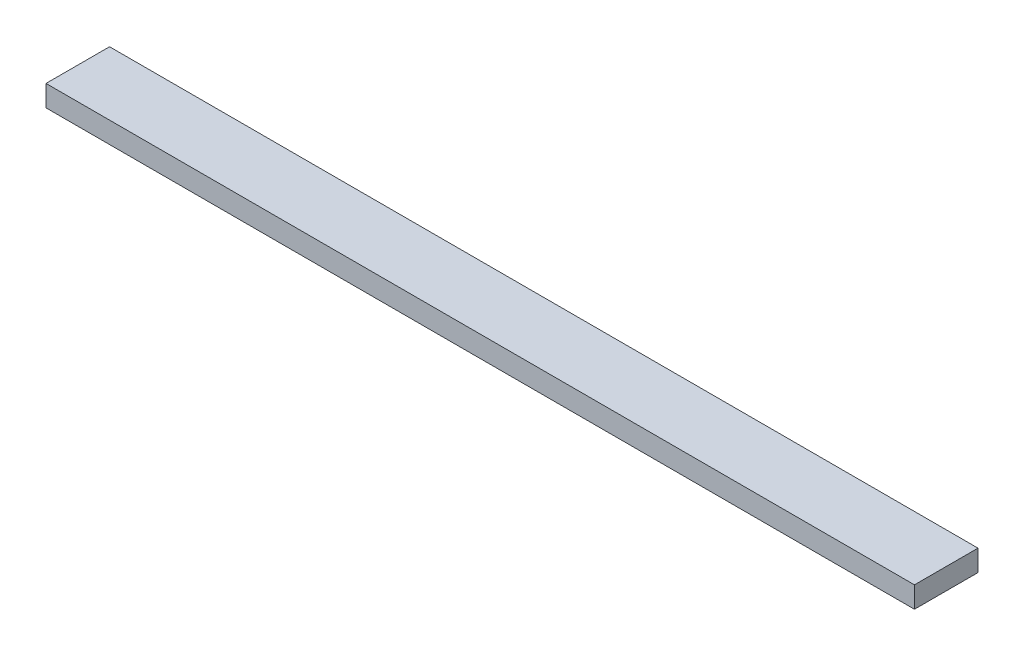
ISO-10303-21;
HEADER;
FILE_DESCRIPTION(('STEP AP214'),'2;1');
FILE_NAME('part.step','',(''),(''),'','','');
FILE_SCHEMA(('AUTOMOTIVE_DESIGN { 1 0 10303 214 1 1 1 1 }'));
ENDSEC;
DATA;
#1=APPLICATION_CONTEXT('core data for automotive mechanical design processes');
#2=APPLICATION_PROTOCOL_DEFINITION('international standard','automotive_design',2000,#1);
#3=PRODUCT_CONTEXT('',#1,'mechanical');
#4=PRODUCT('Part','Part','',(#3));
#5=PRODUCT_RELATED_PRODUCT_CATEGORY('part','',(#4));
#6=PRODUCT_DEFINITION_FORMATION('','',#4);
#7=PRODUCT_DEFINITION_CONTEXT('part definition',#1,'design');
#8=PRODUCT_DEFINITION('design','',#6,#7);
#9=PRODUCT_DEFINITION_SHAPE('','',#8);
#10=(LENGTH_UNIT() NAMED_UNIT(*) SI_UNIT(.MILLI.,.METRE.));
#11=(NAMED_UNIT(*) PLANE_ANGLE_UNIT() SI_UNIT($,.RADIAN.));
#12=(NAMED_UNIT(*) SI_UNIT($,.STERADIAN.) SOLID_ANGLE_UNIT());
#13=UNCERTAINTY_MEASURE_WITH_UNIT(LENGTH_MEASURE(1.E-05),#10,'distance_accuracy_value','');
#14=(GEOMETRIC_REPRESENTATION_CONTEXT(3) GLOBAL_UNCERTAINTY_ASSIGNED_CONTEXT((#13)) GLOBAL_UNIT_ASSIGNED_CONTEXT((#10,
#11,#12)) REPRESENTATION_CONTEXT('',''));
#15=CARTESIAN_POINT('',(0.,0.,0.));
#16=DIRECTION('',(0.,0.,1.));
#17=DIRECTION('',(1.,0.,0.));
#18=AXIS2_PLACEMENT_3D('',#15,#16,#17);
#19=CARTESIAN_POINT('',(-205.,10.,-15.));
#20=DIRECTION('',(1.,0.,0.));
#21=DIRECTION('',(0.,0.,-1.));
#22=AXIS2_PLACEMENT_3D('',#19,#20,#21);
#23=PLANE('',#22);
#24=DIRECTION('',(0.,0.,1.));
#25=VECTOR('',#24,1.);
#26=CARTESIAN_POINT('',(-205.,0.,-15.));
#27=LINE('',#26,#25);
#28=CARTESIAN_POINT('',(-205.,0.,-15.));
#29=VERTEX_POINT('',#28);
#30=CARTESIAN_POINT('',(-205.,0.,15.));
#31=VERTEX_POINT('',#30);
#32=EDGE_CURVE('E97',#29,#31,#27,.T.);
#33=ORIENTED_EDGE('',*,*,#32,.T.);
#34=DIRECTION('',(0.,-1.,0.));
#35=VECTOR('',#34,1.);
#36=CARTESIAN_POINT('',(-205.,10.,15.));
#37=LINE('',#36,#35);
#38=CARTESIAN_POINT('',(-205.,10.,15.));
#39=VERTEX_POINT('',#38);
#40=EDGE_CURVE('E11',#39,#31,#37,.T.);
#41=ORIENTED_EDGE('',*,*,#40,.F.);
#42=DIRECTION('',(0.,0.,1.));
#43=VECTOR('',#42,1.);
#44=CARTESIAN_POINT('',(-205.,10.,-15.));
#45=LINE('',#44,#43);
#46=CARTESIAN_POINT('',(-205.,10.,-15.));
#47=VERTEX_POINT('',#46);
#48=EDGE_CURVE('E85',#47,#39,#45,.T.);
#49=ORIENTED_EDGE('',*,*,#48,.F.);
#50=DIRECTION('',(0.,-1.,0.));
#51=VECTOR('',#50,1.);
#52=CARTESIAN_POINT('',(-205.,10.,-15.));
#53=LINE('',#52,#51);
#54=EDGE_CURVE('E93',#47,#29,#53,.T.);
#55=ORIENTED_EDGE('',*,*,#54,.T.);
#56=EDGE_LOOP('',(#33,#41,#49,#55));
#57=FACE_BOUND('',#56,.T.);
#58=ADVANCED_FACE('F34',(#57),#23,.F.);
#59=CARTESIAN_POINT('',(-205.,10.,15.));
#60=DIRECTION('',(0.,0.,-1.));
#61=DIRECTION('',(-1.,0.,0.));
#62=AXIS2_PLACEMENT_3D('',#59,#60,#61);
#63=PLANE('',#62);
#64=DIRECTION('',(1.,0.,0.));
#65=VECTOR('',#64,1.);
#66=CARTESIAN_POINT('',(-205.,0.,15.));
#67=LINE('',#66,#65);
#68=CARTESIAN_POINT('',(205.,0.,15.));
#69=VERTEX_POINT('',#68);
#70=EDGE_CURVE('E89',#31,#69,#67,.T.);
#71=ORIENTED_EDGE('',*,*,#70,.T.);
#72=DIRECTION('',(0.,-1.,0.));
#73=VECTOR('',#72,1.);
#74=CARTESIAN_POINT('',(205.,10.,15.));
#75=LINE('',#74,#73);
#76=CARTESIAN_POINT('',(205.,10.,15.));
#77=VERTEX_POINT('',#76);
#78=EDGE_CURVE('E42',#77,#69,#75,.T.);
#79=ORIENTED_EDGE('',*,*,#78,.F.);
#80=DIRECTION('',(1.,0.,0.));
#81=VECTOR('',#80,1.);
#82=CARTESIAN_POINT('',(-205.,10.,15.));
#83=LINE('',#82,#81);
#84=EDGE_CURVE('E80',#39,#77,#83,.T.);
#85=ORIENTED_EDGE('',*,*,#84,.F.);
#86=ORIENTED_EDGE('',*,*,#40,.T.);
#87=EDGE_LOOP('',(#71,#79,#85,#86));
#88=FACE_BOUND('',#87,.T.);
#89=ADVANCED_FACE('F88',(#88),#63,.F.);
#90=CARTESIAN_POINT('',(205.,10.,-15.));
#91=DIRECTION('',(-1.,0.,0.));
#92=DIRECTION('',(0.,0.,1.));
#93=AXIS2_PLACEMENT_3D('',#90,#91,#92);
#94=PLANE('',#93);
#95=DIRECTION('',(0.,0.,-1.));
#96=VECTOR('',#95,1.);
#97=CARTESIAN_POINT('',(205.,0.,-15.));
#98=LINE('',#97,#96);
#99=CARTESIAN_POINT('',(205.,0.,-15.));
#100=VERTEX_POINT('',#99);
#101=EDGE_CURVE('E67',#69,#100,#98,.T.);
#102=ORIENTED_EDGE('',*,*,#101,.T.);
#103=DIRECTION('',(0.,-1.,0.));
#104=VECTOR('',#103,1.);
#105=CARTESIAN_POINT('',(205.,10.,-15.));
#106=LINE('',#105,#104);
#107=CARTESIAN_POINT('',(205.,10.,-15.));
#108=VERTEX_POINT('',#107);
#109=EDGE_CURVE('E90',#108,#100,#106,.T.);
#110=ORIENTED_EDGE('',*,*,#109,.F.);
#111=DIRECTION('',(0.,0.,-1.));
#112=VECTOR('',#111,1.);
#113=CARTESIAN_POINT('',(205.,10.,-15.));
#114=LINE('',#113,#112);
#115=EDGE_CURVE('E83',#77,#108,#114,.T.);
#116=ORIENTED_EDGE('',*,*,#115,.F.);
#117=ORIENTED_EDGE('',*,*,#78,.T.);
#118=EDGE_LOOP('',(#102,#110,#116,#117));
#119=FACE_BOUND('',#118,.T.);
#120=ADVANCED_FACE('F91',(#119),#94,.F.);
#121=CARTESIAN_POINT('',(-205.,10.,-15.));
#122=DIRECTION('',(0.,0.,1.));
#123=DIRECTION('',(1.,0.,0.));
#124=AXIS2_PLACEMENT_3D('',#121,#122,#123);
#125=PLANE('',#124);
#126=DIRECTION('',(-1.,0.,0.));
#127=VECTOR('',#126,1.);
#128=CARTESIAN_POINT('',(-205.,0.,-15.));
#129=LINE('',#128,#127);
#130=EDGE_CURVE('E73',#100,#29,#129,.T.);
#131=ORIENTED_EDGE('',*,*,#130,.T.);
#132=ORIENTED_EDGE('',*,*,#54,.F.);
#133=DIRECTION('',(-1.,0.,0.));
#134=VECTOR('',#133,1.);
#135=CARTESIAN_POINT('',(-205.,10.,-15.));
#136=LINE('',#135,#134);
#137=EDGE_CURVE('E50',#108,#47,#136,.T.);
#138=ORIENTED_EDGE('',*,*,#137,.F.);
#139=ORIENTED_EDGE('',*,*,#109,.T.);
#140=EDGE_LOOP('',(#131,#132,#138,#139));
#141=FACE_BOUND('',#140,.T.);
#142=ADVANCED_FACE('F104',(#141),#125,.F.);
#143=CARTESIAN_POINT('',(0.,10.,0.));
#144=DIRECTION('',(0.,1.,0.));
#145=DIRECTION('',(0.,0.,1.));
#146=AXIS2_PLACEMENT_3D('',#143,#144,#145);
#147=PLANE('',#146);
#148=ORIENTED_EDGE('',*,*,#48,.T.);
#149=ORIENTED_EDGE('',*,*,#84,.T.);
#150=ORIENTED_EDGE('',*,*,#115,.T.);
#151=ORIENTED_EDGE('',*,*,#137,.T.);
#152=EDGE_LOOP('',(#148,#149,#150,#151));
#153=FACE_BOUND('',#152,.T.);
#154=ADVANCED_FACE('F81',(#153),#147,.T.);
#155=CARTESIAN_POINT('',(0.,0.,0.));
#156=DIRECTION('',(0.,1.,0.));
#157=DIRECTION('',(0.,0.,1.));
#158=AXIS2_PLACEMENT_3D('',#155,#156,#157);
#159=PLANE('',#158);
#160=ORIENTED_EDGE('',*,*,#32,.F.);
#161=ORIENTED_EDGE('',*,*,#130,.F.);
#162=ORIENTED_EDGE('',*,*,#101,.F.);
#163=ORIENTED_EDGE('',*,*,#70,.F.);
#164=EDGE_LOOP('',(#160,#161,#162,#163));
#165=FACE_BOUND('',#164,.T.);
#166=ADVANCED_FACE('F107',(#165),#159,.F.);
#167=CLOSED_SHELL('',(#58,#89,#120,#142,#154,#166));
#168=MANIFOLD_SOLID_BREP('B2',#167);
#169=ADVANCED_BREP_SHAPE_REPRESENTATION('',(#18,#168),#14);
#170=SHAPE_DEFINITION_REPRESENTATION(#9,#169);
ENDSEC;
END-ISO-10303-21;
